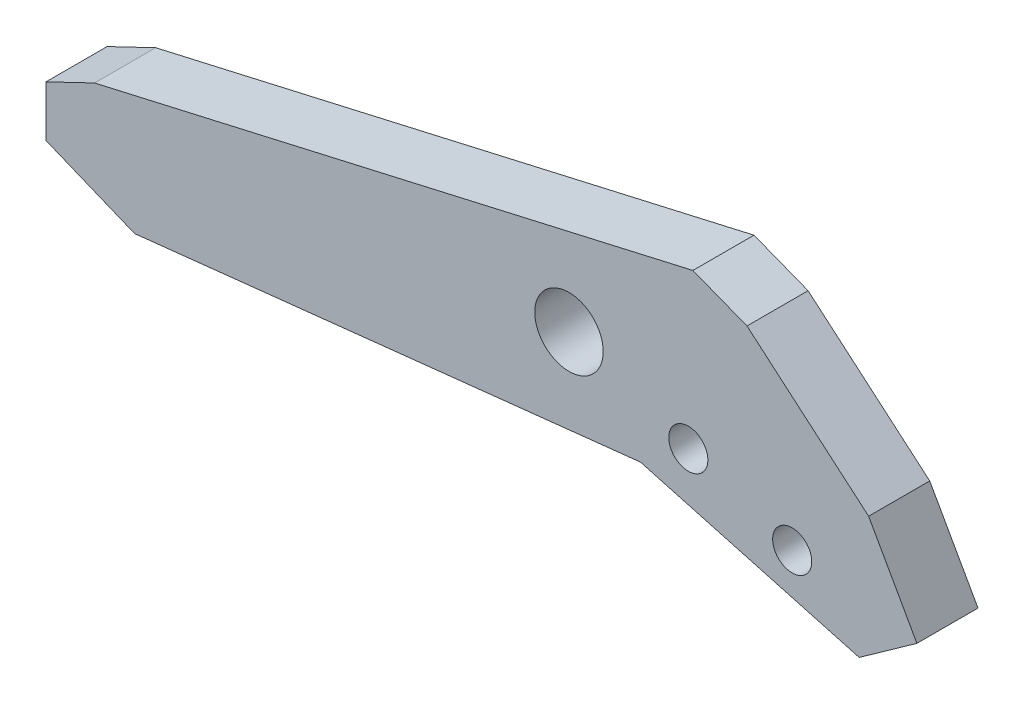
ISO-10303-21;
HEADER;
FILE_DESCRIPTION(('STEP AP214'),'2;1');
FILE_NAME('part.step','',(''),(''),'','','');
FILE_SCHEMA(('AUTOMOTIVE_DESIGN { 1 0 10303 214 1 1 1 1 }'));
ENDSEC;
DATA;
#1=APPLICATION_CONTEXT('core data for automotive mechanical design processes');
#2=APPLICATION_PROTOCOL_DEFINITION('international standard','automotive_design',2000,#1);
#3=PRODUCT_CONTEXT('',#1,'mechanical');
#4=PRODUCT('Part','Part','',(#3));
#5=PRODUCT_RELATED_PRODUCT_CATEGORY('part','',(#4));
#6=PRODUCT_DEFINITION_FORMATION('','',#4);
#7=PRODUCT_DEFINITION_CONTEXT('part definition',#1,'design');
#8=PRODUCT_DEFINITION('design','',#6,#7);
#9=PRODUCT_DEFINITION_SHAPE('','',#8);
#10=(LENGTH_UNIT() NAMED_UNIT(*) SI_UNIT(.MILLI.,.METRE.));
#11=(NAMED_UNIT(*) PLANE_ANGLE_UNIT() SI_UNIT($,.RADIAN.));
#12=(NAMED_UNIT(*) SI_UNIT($,.STERADIAN.) SOLID_ANGLE_UNIT());
#13=UNCERTAINTY_MEASURE_WITH_UNIT(LENGTH_MEASURE(1.E-05),#10,'distance_accuracy_value','');
#14=(GEOMETRIC_REPRESENTATION_CONTEXT(3) GLOBAL_UNCERTAINTY_ASSIGNED_CONTEXT((#13)) GLOBAL_UNIT_ASSIGNED_CONTEXT((#10,
#11,#12)) REPRESENTATION_CONTEXT('',''));
#15=CARTESIAN_POINT('',(0.,0.,0.));
#16=DIRECTION('',(0.,0.,1.));
#17=DIRECTION('',(1.,0.,0.));
#18=AXIS2_PLACEMENT_3D('',#15,#16,#17);
#19=CARTESIAN_POINT('',(-22.225,0.,3.175));
#20=DIRECTION('',(1.,0.,0.));
#21=DIRECTION('',(0.,0.,-1.));
#22=AXIS2_PLACEMENT_3D('',#19,#20,#21);
#23=PLANE('',#22);
#24=DIRECTION('',(0.,-1.,0.));
#25=VECTOR('',#24,1.);
#26=CARTESIAN_POINT('',(-22.225,0.,0.));
#27=LINE('',#26,#25);
#28=CARTESIAN_POINT('',(-22.225,0.,0.));
#29=VERTEX_POINT('',#28);
#30=CARTESIAN_POINT('',(-22.225,-2.64369295925526,0.));
#31=VERTEX_POINT('',#30);
#32=EDGE_CURVE('E138',#29,#31,#27,.T.);
#33=ORIENTED_EDGE('',*,*,#32,.T.);
#34=DIRECTION('',(0.,0.,-1.));
#35=VECTOR('',#34,1.);
#36=CARTESIAN_POINT('',(-22.225,-2.64369295925526,3.175));
#37=LINE('',#36,#35);
#38=CARTESIAN_POINT('',(-22.225,-2.64369295925526,3.175));
#39=VERTEX_POINT('',#38);
#40=EDGE_CURVE('E11',#39,#31,#37,.T.);
#41=ORIENTED_EDGE('',*,*,#40,.F.);
#42=DIRECTION('',(0.,-1.,0.));
#43=VECTOR('',#42,1.);
#44=CARTESIAN_POINT('',(-22.225,0.,3.175));
#45=LINE('',#44,#43);
#46=CARTESIAN_POINT('',(-22.225,0.,3.175));
#47=VERTEX_POINT('',#46);
#48=EDGE_CURVE('E157',#47,#39,#45,.T.);
#49=ORIENTED_EDGE('',*,*,#48,.F.);
#50=DIRECTION('',(0.,0.,-1.));
#51=VECTOR('',#50,1.);
#52=CARTESIAN_POINT('',(-22.225,0.,3.175));
#53=LINE('',#52,#51);
#54=EDGE_CURVE('E134',#47,#29,#53,.T.);
#55=ORIENTED_EDGE('',*,*,#54,.T.);
#56=EDGE_LOOP('',(#33,#41,#49,#55));
#57=FACE_BOUND('',#56,.T.);
#58=ADVANCED_FACE('F30',(#57),#23,.F.);
#59=CARTESIAN_POINT('',(-22.225,-2.64369295925526,3.175));
#60=DIRECTION('',(0.378556847769366,0.925578042634397,0.));
#61=DIRECTION('',(-0.925578042634397,0.378556847769366,0.));
#62=AXIS2_PLACEMENT_3D('',#59,#60,#61);
#63=PLANE('',#62);
#64=DIRECTION('',(0.925578042634397,-0.378556847769366,0.));
#65=VECTOR('',#64,1.);
#66=CARTESIAN_POINT('',(-22.225,-2.64369295925526,0.));
#67=LINE('',#66,#65);
#68=CARTESIAN_POINT('',(-17.6190557509628,-4.52750140716773,0.));
#69=VERTEX_POINT('',#68);
#70=EDGE_CURVE('E141',#31,#69,#67,.T.);
#71=ORIENTED_EDGE('',*,*,#70,.T.);
#72=DIRECTION('',(0.,0.,-1.));
#73=VECTOR('',#72,1.);
#74=CARTESIAN_POINT('',(-17.6190557509628,-4.52750140716773,3.175));
#75=LINE('',#74,#73);
#76=CARTESIAN_POINT('',(-17.6190557509628,-4.52750140716773,3.175));
#77=VERTEX_POINT('',#76);
#78=EDGE_CURVE('E38',#77,#69,#75,.T.);
#79=ORIENTED_EDGE('',*,*,#78,.F.);
#80=DIRECTION('',(0.925578042634397,-0.378556847769366,0.));
#81=VECTOR('',#80,1.);
#82=CARTESIAN_POINT('',(-22.225,-2.64369295925526,3.175));
#83=LINE('',#82,#81);
#84=EDGE_CURVE('E94',#39,#77,#83,.T.);
#85=ORIENTED_EDGE('',*,*,#84,.F.);
#86=ORIENTED_EDGE('',*,*,#40,.T.);
#87=EDGE_LOOP('',(#71,#79,#85,#86));
#88=FACE_BOUND('',#87,.T.);
#89=ADVANCED_FACE('F252',(#88),#63,.F.);
#90=CARTESIAN_POINT('',(-17.6190557509628,-4.52750140716773,3.175));
#91=DIRECTION('',(-0.108138582606043,0.994135829226548,0.));
#92=DIRECTION('',(-0.994135829226548,-0.108138582606043,0.));
#93=AXIS2_PLACEMENT_3D('',#90,#91,#92);
#94=PLANE('',#93);
#95=DIRECTION('',(0.994135829226548,0.108138582606043,0.));
#96=VECTOR('',#95,1.);
#97=CARTESIAN_POINT('',(-17.6190557509628,-4.52750140716773,0.));
#98=LINE('',#97,#96);
#99=CARTESIAN_POINT('',(8.66672872223262,-1.6682266561201,0.));
#100=VERTEX_POINT('',#99);
#101=EDGE_CURVE('E144',#69,#100,#98,.T.);
#102=ORIENTED_EDGE('',*,*,#101,.T.);
#103=DIRECTION('',(0.,0.,-1.));
#104=VECTOR('',#103,1.);
#105=CARTESIAN_POINT('',(8.66672872223262,-1.6682266561201,3.175));
#106=LINE('',#105,#104);
#107=CARTESIAN_POINT('',(8.66672872223262,-1.6682266561201,3.175));
#108=VERTEX_POINT('',#107);
#109=EDGE_CURVE('E170',#108,#100,#106,.T.);
#110=ORIENTED_EDGE('',*,*,#109,.F.);
#111=DIRECTION('',(0.994135829226548,0.108138582606043,0.));
#112=VECTOR('',#111,1.);
#113=CARTESIAN_POINT('',(-17.6190557509628,-4.52750140716773,3.175));
#114=LINE('',#113,#112);
#115=EDGE_CURVE('E178',#77,#108,#114,.T.);
#116=ORIENTED_EDGE('',*,*,#115,.F.);
#117=ORIENTED_EDGE('',*,*,#78,.T.);
#118=EDGE_LOOP('',(#102,#110,#116,#117));
#119=FACE_BOUND('',#118,.T.);
#120=ADVANCED_FACE('F176',(#119),#94,.F.);
#121=CARTESIAN_POINT('',(8.66672872223262,-1.6682266561201,3.175));
#122=DIRECTION('',(0.263769238458543,0.964585812068061,0.));
#123=DIRECTION('',(-0.964585812068061,0.263769238458543,0.));
#124=AXIS2_PLACEMENT_3D('',#121,#122,#123);
#125=PLANE('',#124);
#126=DIRECTION('',(0.964585812068061,-0.263769238458543,0.));
#127=VECTOR('',#126,1.);
#128=CARTESIAN_POINT('',(8.66672872223262,-1.6682266561201,0.));
#129=LINE('',#128,#127);
#130=CARTESIAN_POINT('',(20.0330368729595,-4.77638189486917,0.));
#131=VERTEX_POINT('',#130);
#132=EDGE_CURVE('E146',#100,#131,#129,.T.);
#133=ORIENTED_EDGE('',*,*,#132,.T.);
#134=DIRECTION('',(0.,0.,-1.));
#135=VECTOR('',#134,1.);
#136=CARTESIAN_POINT('',(20.0330368729595,-4.77638189486917,3.175));
#137=LINE('',#136,#135);
#138=CARTESIAN_POINT('',(20.0330368729595,-4.77638189486917,3.175));
#139=VERTEX_POINT('',#138);
#140=EDGE_CURVE('E167',#139,#131,#137,.T.);
#141=ORIENTED_EDGE('',*,*,#140,.F.);
#142=DIRECTION('',(0.964585812068061,-0.263769238458543,0.));
#143=VECTOR('',#142,1.);
#144=CARTESIAN_POINT('',(8.66672872223262,-1.6682266561201,3.175));
#145=LINE('',#144,#143);
#146=EDGE_CURVE('E196',#108,#139,#145,.T.);
#147=ORIENTED_EDGE('',*,*,#146,.F.);
#148=ORIENTED_EDGE('',*,*,#109,.T.);
#149=EDGE_LOOP('',(#133,#141,#147,#148));
#150=FACE_BOUND('',#149,.T.);
#151=ADVANCED_FACE('F187',(#150),#125,.F.);
#152=CARTESIAN_POINT('',(20.0330368729595,-4.77638189486917,3.175));
#153=DIRECTION('',(-0.579614348655488,0.81489091713718,0.));
#154=DIRECTION('',(-0.81489091713718,-0.579614348655488,0.));
#155=AXIS2_PLACEMENT_3D('',#152,#153,#154);
#156=PLANE('',#155);
#157=DIRECTION('',(0.81489091713718,0.579614348655488,0.));
#158=VECTOR('',#157,1.);
#159=CARTESIAN_POINT('',(20.0330368729595,-4.77638189486917,0.));
#160=LINE('',#159,#158);
#161=CARTESIAN_POINT('',(23.0314251060012,-2.64369295925526,0.));
#162=VERTEX_POINT('',#161);
#163=EDGE_CURVE('E148',#131,#162,#160,.T.);
#164=ORIENTED_EDGE('',*,*,#163,.T.);
#165=DIRECTION('',(0.,0.,-1.));
#166=VECTOR('',#165,1.);
#167=CARTESIAN_POINT('',(23.0314251060012,-2.64369295925526,3.175));
#168=LINE('',#167,#166);
#169=CARTESIAN_POINT('',(23.0314251060012,-2.64369295925526,3.175));
#170=VERTEX_POINT('',#169);
#171=EDGE_CURVE('E164',#170,#162,#168,.T.);
#172=ORIENTED_EDGE('',*,*,#171,.F.);
#173=DIRECTION('',(0.81489091713718,0.579614348655488,0.));
#174=VECTOR('',#173,1.);
#175=CARTESIAN_POINT('',(20.0330368729595,-4.77638189486917,3.175));
#176=LINE('',#175,#174);
#177=EDGE_CURVE('E193',#139,#170,#176,.T.);
#178=ORIENTED_EDGE('',*,*,#177,.F.);
#179=ORIENTED_EDGE('',*,*,#140,.T.);
#180=EDGE_LOOP('',(#164,#172,#178,#179));
#181=FACE_BOUND('',#180,.T.);
#182=ADVANCED_FACE('F191',(#181),#156,.F.);
#183=CARTESIAN_POINT('',(23.0314251060012,-2.64369295925526,3.175));
#184=DIRECTION('',(-0.872033604798417,-0.48944600529811,0.));
#185=DIRECTION('',(0.48944600529811,-0.872033604798418,0.));
#186=AXIS2_PLACEMENT_3D('',#183,#184,#185);
#187=PLANE('',#186);
#188=DIRECTION('',(-0.48944600529811,0.872033604798417,0.));
#189=VECTOR('',#188,1.);
#190=CARTESIAN_POINT('',(23.0314251060012,-2.64369295925526,0.));
#191=LINE('',#190,#189);
#192=CARTESIAN_POINT('',(20.5229536680775,1.82558734310234,0.));
#193=VERTEX_POINT('',#192);
#194=EDGE_CURVE('E150',#162,#193,#191,.T.);
#195=ORIENTED_EDGE('',*,*,#194,.T.);
#196=DIRECTION('',(0.,0.,-1.));
#197=VECTOR('',#196,1.);
#198=CARTESIAN_POINT('',(20.5229536680775,1.82558734310234,3.175));
#199=LINE('',#198,#197);
#200=CARTESIAN_POINT('',(20.5229536680775,1.82558734310234,3.175));
#201=VERTEX_POINT('',#200);
#202=EDGE_CURVE('E161',#201,#193,#199,.T.);
#203=ORIENTED_EDGE('',*,*,#202,.F.);
#204=DIRECTION('',(-0.48944600529811,0.872033604798417,0.));
#205=VECTOR('',#204,1.);
#206=CARTESIAN_POINT('',(23.0314251060012,-2.64369295925526,3.175));
#207=LINE('',#206,#205);
#208=EDGE_CURVE('E195',#170,#201,#207,.T.);
#209=ORIENTED_EDGE('',*,*,#208,.F.);
#210=ORIENTED_EDGE('',*,*,#171,.T.);
#211=EDGE_LOOP('',(#195,#203,#209,#210));
#212=FACE_BOUND('',#211,.T.);
#213=ADVANCED_FACE('F264',(#212),#187,.F.);
#214=CARTESIAN_POINT('',(14.2021936533017,7.2256958098981,3.175));
#215=DIRECTION('',(-0.649564152569591,-0.760306787880096,0.));
#216=DIRECTION('',(0.760306787880096,-0.649564152569591,0.));
#217=AXIS2_PLACEMENT_3D('',#214,#215,#216);
#218=PLANE('',#217);
#219=DIRECTION('',(-0.760306787880096,0.649564152569591,0.));
#220=VECTOR('',#219,1.);
#221=CARTESIAN_POINT('',(14.2021936533017,7.2256958098981,0.));
#222=LINE('',#221,#220);
#223=CARTESIAN_POINT('',(14.2021936533017,7.2256958098981,0.));
#224=VERTEX_POINT('',#223);
#225=EDGE_CURVE('E152',#193,#224,#222,.T.);
#226=ORIENTED_EDGE('',*,*,#225,.T.);
#227=DIRECTION('',(0.,0.,-1.));
#228=VECTOR('',#227,1.);
#229=CARTESIAN_POINT('',(14.2021936533017,7.2256958098981,3.175));
#230=LINE('',#229,#228);
#231=CARTESIAN_POINT('',(14.2021936533017,7.2256958098981,3.175));
#232=VERTEX_POINT('',#231);
#233=EDGE_CURVE('E129',#232,#224,#230,.T.);
#234=ORIENTED_EDGE('',*,*,#233,.F.);
#235=DIRECTION('',(-0.760306787880096,0.649564152569591,0.));
#236=VECTOR('',#235,1.);
#237=CARTESIAN_POINT('',(14.2021936533017,7.2256958098981,3.175));
#238=LINE('',#237,#236);
#239=EDGE_CURVE('E119',#201,#232,#238,.T.);
#240=ORIENTED_EDGE('',*,*,#239,.F.);
#241=ORIENTED_EDGE('',*,*,#202,.T.);
#242=EDGE_LOOP('',(#226,#234,#240,#241));
#243=FACE_BOUND('',#242,.T.);
#244=ADVANCED_FACE('F261',(#243),#218,.F.);
#245=CARTESIAN_POINT('',(11.3914526476454,8.3197957466619,3.175));
#246=DIRECTION('',(-0.362744022870218,-0.931888820553144,0.));
#247=DIRECTION('',(0.931888820553145,-0.362744022870218,0.));
#248=AXIS2_PLACEMENT_3D('',#245,#246,#247);
#249=PLANE('',#248);
#250=DIRECTION('',(-0.931888820553144,0.362744022870218,0.));
#251=VECTOR('',#250,1.);
#252=CARTESIAN_POINT('',(11.3914526476454,8.3197957466619,0.));
#253=LINE('',#252,#251);
#254=CARTESIAN_POINT('',(11.3914526476454,8.3197957466619,0.));
#255=VERTEX_POINT('',#254);
#256=EDGE_CURVE('E128',#224,#255,#253,.T.);
#257=ORIENTED_EDGE('',*,*,#256,.T.);
#258=DIRECTION('',(0.,0.,-1.));
#259=VECTOR('',#258,1.);
#260=CARTESIAN_POINT('',(11.3914526476454,8.3197957466619,3.175));
#261=LINE('',#260,#259);
#262=CARTESIAN_POINT('',(11.3914526476454,8.3197957466619,3.175));
#263=VERTEX_POINT('',#262);
#264=EDGE_CURVE('E125',#263,#255,#261,.T.);
#265=ORIENTED_EDGE('',*,*,#264,.F.);
#266=DIRECTION('',(-0.931888820553144,0.362744022870218,0.));
#267=VECTOR('',#266,1.);
#268=CARTESIAN_POINT('',(11.3914526476454,8.3197957466619,3.175));
#269=LINE('',#268,#267);
#270=EDGE_CURVE('E113',#232,#263,#269,.T.);
#271=ORIENTED_EDGE('',*,*,#270,.F.);
#272=ORIENTED_EDGE('',*,*,#233,.T.);
#273=EDGE_LOOP('',(#257,#265,#271,#272));
#274=FACE_BOUND('',#273,.T.);
#275=ADVANCED_FACE('F126',(#274),#249,.F.);
#276=CARTESIAN_POINT('',(0.,5.715,3.175));
#277=DIRECTION('',(0.222908986072901,-0.974839260559376,0.));
#278=DIRECTION('',(0.974839260559376,0.222908986072901,0.));
#279=AXIS2_PLACEMENT_3D('',#276,#277,#278);
#280=PLANE('',#279);
#281=DIRECTION('',(-0.974839260559376,-0.222908986072901,0.));
#282=VECTOR('',#281,1.);
#283=CARTESIAN_POINT('',(0.,5.715,0.));
#284=LINE('',#283,#282);
#285=CARTESIAN_POINT('',(-19.7003208959714,1.2102793410147,0.));
#286=VERTEX_POINT('',#285);
#287=EDGE_CURVE('E80',#255,#286,#284,.T.);
#288=ORIENTED_EDGE('',*,*,#287,.T.);
#289=DIRECTION('',(0.,0.,-1.));
#290=VECTOR('',#289,1.);
#291=CARTESIAN_POINT('',(-19.7003208959714,1.2102793410147,3.175));
#292=LINE('',#291,#290);
#293=CARTESIAN_POINT('',(-19.7003208959714,1.2102793410147,3.175));
#294=VERTEX_POINT('',#293);
#295=EDGE_CURVE('E130',#294,#286,#292,.T.);
#296=ORIENTED_EDGE('',*,*,#295,.F.);
#297=DIRECTION('',(-0.974839260559376,-0.222908986072901,0.));
#298=VECTOR('',#297,1.);
#299=CARTESIAN_POINT('',(0.,5.715,3.175));
#300=LINE('',#299,#298);
#301=EDGE_CURVE('E117',#263,#294,#300,.T.);
#302=ORIENTED_EDGE('',*,*,#301,.F.);
#303=ORIENTED_EDGE('',*,*,#264,.T.);
#304=EDGE_LOOP('',(#288,#296,#302,#303));
#305=FACE_BOUND('',#304,.T.);
#306=ADVANCED_FACE('F132',(#305),#280,.F.);
#307=CARTESIAN_POINT('',(-19.7003208959714,1.2102793410147,3.175));
#308=DIRECTION('',(0.432276238596488,-0.901741234248979,0.));
#309=DIRECTION('',(0.901741234248979,0.432276238596488,0.));
#310=AXIS2_PLACEMENT_3D('',#307,#308,#309);
#311=PLANE('',#310);
#312=DIRECTION('',(-0.901741234248979,-0.432276238596488,0.));
#313=VECTOR('',#312,1.);
#314=CARTESIAN_POINT('',(-19.7003208959714,1.2102793410147,0.));
#315=LINE('',#314,#313);
#316=EDGE_CURVE('E86',#286,#29,#315,.T.);
#317=ORIENTED_EDGE('',*,*,#316,.T.);
#318=ORIENTED_EDGE('',*,*,#54,.F.);
#319=DIRECTION('',(-0.901741234248979,-0.432276238596488,0.));
#320=VECTOR('',#319,1.);
#321=CARTESIAN_POINT('',(-19.7003208959714,1.2102793410147,3.175));
#322=LINE('',#321,#320);
#323=EDGE_CURVE('E46',#294,#47,#322,.T.);
#324=ORIENTED_EDGE('',*,*,#323,.F.);
#325=ORIENTED_EDGE('',*,*,#295,.T.);
#326=EDGE_LOOP('',(#317,#318,#324,#325));
#327=FACE_BOUND('',#326,.T.);
#328=ADVANCED_FACE('F233',(#327),#311,.F.);
#329=CARTESIAN_POINT('',(-22.225,-5.02851974692604,3.175));
#330=DIRECTION('',(0.,0.,1.));
#331=DIRECTION('',(1.,0.,0.));
#332=AXIS2_PLACEMENT_3D('',#329,#330,#331);
#333=PLANE('',#332);
#334=CARTESIAN_POINT('',(4.95156440229834,2.3340262714552,3.175));
#335=DIRECTION('',(0.,0.,1.));
#336=DIRECTION('',(1.,0.,0.));
#337=AXIS2_PLACEMENT_3D('',#334,#335,#336);
#338=CIRCLE('',#337,1.778);
#339=CARTESIAN_POINT('',(6.72956440229834,2.3340262714552,3.175));
#340=VERTEX_POINT('',#339);
#341=EDGE_CURVE('E216',#340,#340,#338,.T.);
#342=ORIENTED_EDGE('',*,*,#341,.F.);
#343=EDGE_LOOP('',(#342));
#344=FACE_BOUND('',#343,.T.);
#345=CARTESIAN_POINT('',(16.5511572759588,-1.69957633357727,3.175));
#346=DIRECTION('',(0.,0.,1.));
#347=DIRECTION('',(1.,0.,0.));
#348=AXIS2_PLACEMENT_3D('',#345,#346,#347);
#349=CIRCLE('',#348,1.016);
#350=CARTESIAN_POINT('',(17.5671572759588,-1.69957633357727,3.175));
#351=VERTEX_POINT('',#350);
#352=EDGE_CURVE('E210',#351,#351,#349,.T.);
#353=ORIENTED_EDGE('',*,*,#352,.F.);
#354=EDGE_LOOP('',(#353));
#355=FACE_BOUND('',#354,.T.);
#356=CARTESIAN_POINT('',(11.1532081620527,0.177487960388202,3.175));
#357=DIRECTION('',(0.,0.,1.));
#358=DIRECTION('',(1.,0.,0.));
#359=AXIS2_PLACEMENT_3D('',#356,#357,#358);
#360=CIRCLE('',#359,1.016);
#361=CARTESIAN_POINT('',(12.1692081620527,0.177487960388202,3.175));
#362=VERTEX_POINT('',#361);
#363=EDGE_CURVE('E204',#362,#362,#360,.T.);
#364=ORIENTED_EDGE('',*,*,#363,.F.);
#365=EDGE_LOOP('',(#364));
#366=FACE_BOUND('',#365,.T.);
#367=ORIENTED_EDGE('',*,*,#48,.T.);
#368=ORIENTED_EDGE('',*,*,#84,.T.);
#369=ORIENTED_EDGE('',*,*,#115,.T.);
#370=ORIENTED_EDGE('',*,*,#146,.T.);
#371=ORIENTED_EDGE('',*,*,#177,.T.);
#372=ORIENTED_EDGE('',*,*,#208,.T.);
#373=ORIENTED_EDGE('',*,*,#239,.T.);
#374=ORIENTED_EDGE('',*,*,#270,.T.);
#375=ORIENTED_EDGE('',*,*,#301,.T.);
#376=ORIENTED_EDGE('',*,*,#323,.T.);
#377=EDGE_LOOP('',(#367,#368,#369,#370,#371,#372,#373,#374,#375,#376));
#378=FACE_BOUND('',#377,.T.);
#379=ADVANCED_FACE('F115',(#344,#355,#366,#378),#333,.T.);
#380=CARTESIAN_POINT('',(-22.225,-5.02851974692604,0.));
#381=DIRECTION('',(0.,0.,1.));
#382=DIRECTION('',(1.,0.,0.));
#383=AXIS2_PLACEMENT_3D('',#380,#381,#382);
#384=PLANE('',#383);
#385=CARTESIAN_POINT('',(4.95156440229834,2.3340262714552,0.));
#386=DIRECTION('',(0.,0.,1.));
#387=DIRECTION('',(1.,0.,0.));
#388=AXIS2_PLACEMENT_3D('',#385,#386,#387);
#389=CIRCLE('',#388,1.778);
#390=CARTESIAN_POINT('',(6.72956440229834,2.3340262714552,0.));
#391=VERTEX_POINT('',#390);
#392=EDGE_CURVE('E213',#391,#391,#389,.T.);
#393=ORIENTED_EDGE('',*,*,#392,.T.);
#394=EDGE_LOOP('',(#393));
#395=FACE_BOUND('',#394,.T.);
#396=CARTESIAN_POINT('',(16.5511572759588,-1.69957633357727,0.));
#397=DIRECTION('',(0.,0.,1.));
#398=DIRECTION('',(1.,0.,0.));
#399=AXIS2_PLACEMENT_3D('',#396,#397,#398);
#400=CIRCLE('',#399,1.016);
#401=CARTESIAN_POINT('',(17.5671572759588,-1.69957633357727,0.));
#402=VERTEX_POINT('',#401);
#403=EDGE_CURVE('E207',#402,#402,#400,.T.);
#404=ORIENTED_EDGE('',*,*,#403,.T.);
#405=EDGE_LOOP('',(#404));
#406=FACE_BOUND('',#405,.T.);
#407=CARTESIAN_POINT('',(11.1532081620527,0.177487960388202,0.));
#408=DIRECTION('',(0.,0.,1.));
#409=DIRECTION('',(1.,0.,0.));
#410=AXIS2_PLACEMENT_3D('',#407,#408,#409);
#411=CIRCLE('',#410,1.016);
#412=CARTESIAN_POINT('',(12.1692081620527,0.177487960388202,0.));
#413=VERTEX_POINT('',#412);
#414=EDGE_CURVE('E142',#413,#413,#411,.T.);
#415=ORIENTED_EDGE('',*,*,#414,.T.);
#416=EDGE_LOOP('',(#415));
#417=FACE_BOUND('',#416,.T.);
#418=ORIENTED_EDGE('',*,*,#32,.F.);
#419=ORIENTED_EDGE('',*,*,#316,.F.);
#420=ORIENTED_EDGE('',*,*,#287,.F.);
#421=ORIENTED_EDGE('',*,*,#256,.F.);
#422=ORIENTED_EDGE('',*,*,#225,.F.);
#423=ORIENTED_EDGE('',*,*,#194,.F.);
#424=ORIENTED_EDGE('',*,*,#163,.F.);
#425=ORIENTED_EDGE('',*,*,#132,.F.);
#426=ORIENTED_EDGE('',*,*,#101,.F.);
#427=ORIENTED_EDGE('',*,*,#70,.F.);
#428=EDGE_LOOP('',(#418,#419,#420,#421,#422,#423,#424,#425,#426,#427));
#429=FACE_BOUND('',#428,.T.);
#430=ADVANCED_FACE('F182',(#395,#406,#417,#429),#384,.F.);
#431=CARTESIAN_POINT('',(11.1532081620527,0.177487960388202,0.));
#432=DIRECTION('',(0.,0.,1.));
#433=DIRECTION('',(1.,0.,0.));
#434=AXIS2_PLACEMENT_3D('',#431,#432,#433);
#435=CYLINDRICAL_SURFACE('',#434,1.016);
#436=ORIENTED_EDGE('',*,*,#414,.F.);
#437=EDGE_LOOP('',(#436));
#438=FACE_BOUND('',#437,.T.);
#439=ORIENTED_EDGE('',*,*,#363,.T.);
#440=EDGE_LOOP('',(#439));
#441=FACE_BOUND('',#440,.T.);
#442=ADVANCED_FACE('F239',(#438,#441),#435,.F.);
#443=CARTESIAN_POINT('',(16.5511572759588,-1.69957633357727,0.));
#444=DIRECTION('',(0.,0.,1.));
#445=DIRECTION('',(1.,0.,0.));
#446=AXIS2_PLACEMENT_3D('',#443,#444,#445);
#447=CYLINDRICAL_SURFACE('',#446,1.016);
#448=ORIENTED_EDGE('',*,*,#403,.F.);
#449=EDGE_LOOP('',(#448));
#450=FACE_BOUND('',#449,.T.);
#451=ORIENTED_EDGE('',*,*,#352,.T.);
#452=EDGE_LOOP('',(#451));
#453=FACE_BOUND('',#452,.T.);
#454=ADVANCED_FACE('F227',(#450,#453),#447,.F.);
#455=CARTESIAN_POINT('',(4.95156440229834,2.3340262714552,0.));
#456=DIRECTION('',(0.,0.,1.));
#457=DIRECTION('',(1.,0.,0.));
#458=AXIS2_PLACEMENT_3D('',#455,#456,#457);
#459=CYLINDRICAL_SURFACE('',#458,1.778);
#460=ORIENTED_EDGE('',*,*,#392,.F.);
#461=EDGE_LOOP('',(#460));
#462=FACE_BOUND('',#461,.T.);
#463=ORIENTED_EDGE('',*,*,#341,.T.);
#464=EDGE_LOOP('',(#463));
#465=FACE_BOUND('',#464,.T.);
#466=ADVANCED_FACE('F224',(#462,#465),#459,.F.);
#467=CLOSED_SHELL('',(#58,#89,#120,#151,#182,#213,#244,#275,#306,#328,#379,#430,#442,#454,#466));
#468=MANIFOLD_SOLID_BREP('B2',#467);
#469=ADVANCED_BREP_SHAPE_REPRESENTATION('',(#18,#468),#14);
#470=SHAPE_DEFINITION_REPRESENTATION(#9,#469);
ENDSEC;
END-ISO-10303-21;
